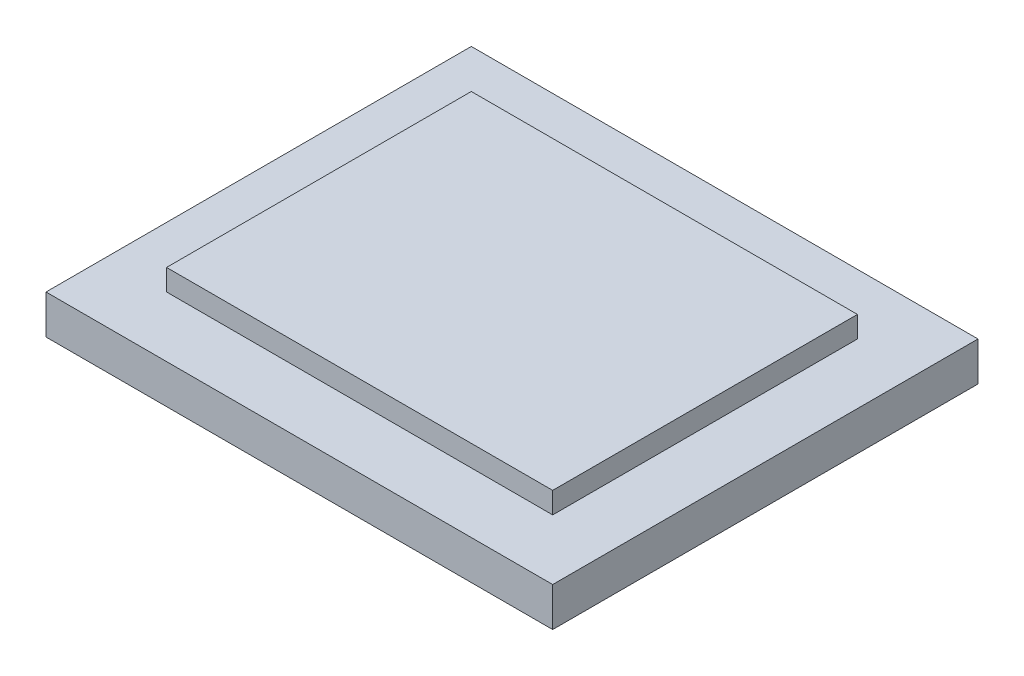
ISO-10303-21;
HEADER;
FILE_DESCRIPTION(('STEP AP214'),'2;1');
FILE_NAME('part.step','',(''),(''),'','','');
FILE_SCHEMA(('AUTOMOTIVE_DESIGN { 1 0 10303 214 1 1 1 1 }'));
ENDSEC;
DATA;
#1=APPLICATION_CONTEXT('core data for automotive mechanical design processes');
#2=APPLICATION_PROTOCOL_DEFINITION('international standard','automotive_design',2000,#1);
#3=PRODUCT_CONTEXT('',#1,'mechanical');
#4=PRODUCT('Part','Part','',(#3));
#5=PRODUCT_RELATED_PRODUCT_CATEGORY('part','',(#4));
#6=PRODUCT_DEFINITION_FORMATION('','',#4);
#7=PRODUCT_DEFINITION_CONTEXT('part definition',#1,'design');
#8=PRODUCT_DEFINITION('design','',#6,#7);
#9=PRODUCT_DEFINITION_SHAPE('','',#8);
#10=(LENGTH_UNIT() NAMED_UNIT(*) SI_UNIT(.MILLI.,.METRE.));
#11=(NAMED_UNIT(*) PLANE_ANGLE_UNIT() SI_UNIT($,.RADIAN.));
#12=(NAMED_UNIT(*) SI_UNIT($,.STERADIAN.) SOLID_ANGLE_UNIT());
#13=UNCERTAINTY_MEASURE_WITH_UNIT(LENGTH_MEASURE(1.E-05),#10,'distance_accuracy_value','');
#14=(GEOMETRIC_REPRESENTATION_CONTEXT(3) GLOBAL_UNCERTAINTY_ASSIGNED_CONTEXT((#13)) GLOBAL_UNIT_ASSIGNED_CONTEXT((#10,
#11,#12)) REPRESENTATION_CONTEXT('',''));
#15=CARTESIAN_POINT('',(0.,0.,0.));
#16=DIRECTION('',(0.,0.,1.));
#17=DIRECTION('',(1.,0.,0.));
#18=AXIS2_PLACEMENT_3D('',#15,#16,#17);
#19=CARTESIAN_POINT('',(-75.65,18.,-63.5));
#20=DIRECTION('',(1.,0.,0.));
#21=DIRECTION('',(0.,0.,-1.));
#22=AXIS2_PLACEMENT_3D('',#19,#20,#21);
#23=PLANE('',#22);
#24=DIRECTION('',(0.,0.,1.));
#25=VECTOR('',#24,1.);
#26=CARTESIAN_POINT('',(-75.65,11.65,-63.5));
#27=LINE('',#26,#25);
#28=CARTESIAN_POINT('',(-75.65,11.65,-63.5));
#29=VERTEX_POINT('',#28);
#30=CARTESIAN_POINT('',(-75.65,11.65,63.5));
#31=VERTEX_POINT('',#30);
#32=EDGE_CURVE('E120',#29,#31,#27,.T.);
#33=ORIENTED_EDGE('',*,*,#32,.F.);
#34=DIRECTION('',(0.,-1.,0.));
#35=VECTOR('',#34,1.);
#36=CARTESIAN_POINT('',(-75.65,18.,-63.5));
#37=LINE('',#36,#35);
#38=CARTESIAN_POINT('',(-75.65,0.,-63.5));
#39=VERTEX_POINT('',#38);
#40=EDGE_CURVE('E57',#29,#39,#37,.T.);
#41=ORIENTED_EDGE('',*,*,#40,.T.);
#42=DIRECTION('',(0.,0.,1.));
#43=VECTOR('',#42,1.);
#44=CARTESIAN_POINT('',(-75.65,0.,-63.5));
#45=LINE('',#44,#43);
#46=CARTESIAN_POINT('',(-75.65,0.,63.5));
#47=VERTEX_POINT('',#46);
#48=EDGE_CURVE('E137',#39,#47,#45,.T.);
#49=ORIENTED_EDGE('',*,*,#48,.T.);
#50=DIRECTION('',(0.,-1.,0.));
#51=VECTOR('',#50,1.);
#52=CARTESIAN_POINT('',(-75.65,18.,63.5));
#53=LINE('',#52,#51);
#54=EDGE_CURVE('E42',#31,#47,#53,.T.);
#55=ORIENTED_EDGE('',*,*,#54,.F.);
#56=EDGE_LOOP('',(#33,#41,#49,#55));
#57=FACE_BOUND('',#56,.T.);
#58=ADVANCED_FACE('F35',(#57),#23,.F.);
#59=CARTESIAN_POINT('',(75.65,18.,-63.5));
#60=DIRECTION('',(-1.,0.,0.));
#61=DIRECTION('',(0.,0.,1.));
#62=AXIS2_PLACEMENT_3D('',#59,#60,#61);
#63=PLANE('',#62);
#64=DIRECTION('',(0.,0.,-1.));
#65=VECTOR('',#64,1.);
#66=CARTESIAN_POINT('',(75.65,11.65,63.5));
#67=LINE('',#66,#65);
#68=CARTESIAN_POINT('',(75.65,11.65,63.5));
#69=VERTEX_POINT('',#68);
#70=CARTESIAN_POINT('',(75.65,11.65,-63.5));
#71=VERTEX_POINT('',#70);
#72=EDGE_CURVE('E129',#69,#71,#67,.T.);
#73=ORIENTED_EDGE('',*,*,#72,.F.);
#74=DIRECTION('',(0.,-1.,0.));
#75=VECTOR('',#74,1.);
#76=CARTESIAN_POINT('',(75.65,18.,63.5));
#77=LINE('',#76,#75);
#78=CARTESIAN_POINT('',(75.65,0.,63.5));
#79=VERTEX_POINT('',#78);
#80=EDGE_CURVE('E151',#69,#79,#77,.T.);
#81=ORIENTED_EDGE('',*,*,#80,.T.);
#82=DIRECTION('',(0.,0.,-1.));
#83=VECTOR('',#82,1.);
#84=CARTESIAN_POINT('',(75.65,0.,-63.5));
#85=LINE('',#84,#83);
#86=CARTESIAN_POINT('',(75.65,0.,-63.5));
#87=VERTEX_POINT('',#86);
#88=EDGE_CURVE('E143',#79,#87,#85,.T.);
#89=ORIENTED_EDGE('',*,*,#88,.T.);
#90=DIRECTION('',(0.,-1.,0.));
#91=VECTOR('',#90,1.);
#92=CARTESIAN_POINT('',(75.65,18.,-63.5));
#93=LINE('',#92,#91);
#94=EDGE_CURVE('E149',#71,#87,#93,.T.);
#95=ORIENTED_EDGE('',*,*,#94,.F.);
#96=EDGE_LOOP('',(#73,#81,#89,#95));
#97=FACE_BOUND('',#96,.T.);
#98=ADVANCED_FACE('F164',(#97),#63,.F.);
#99=CARTESIAN_POINT('',(75.65,18.,63.5));
#100=DIRECTION('',(0.,0.,-1.));
#101=DIRECTION('',(-1.,0.,0.));
#102=AXIS2_PLACEMENT_3D('',#99,#100,#101);
#103=PLANE('',#102);
#104=DIRECTION('',(1.,0.,0.));
#105=VECTOR('',#104,1.);
#106=CARTESIAN_POINT('',(75.65,11.65,63.5));
#107=LINE('',#106,#105);
#108=EDGE_CURVE('E135',#31,#69,#107,.T.);
#109=ORIENTED_EDGE('',*,*,#108,.F.);
#110=ORIENTED_EDGE('',*,*,#54,.T.);
#111=DIRECTION('',(1.,0.,0.));
#112=VECTOR('',#111,1.);
#113=CARTESIAN_POINT('',(75.65,0.,63.5));
#114=LINE('',#113,#112);
#115=EDGE_CURVE('E140',#47,#79,#114,.T.);
#116=ORIENTED_EDGE('',*,*,#115,.T.);
#117=ORIENTED_EDGE('',*,*,#80,.F.);
#118=EDGE_LOOP('',(#109,#110,#116,#117));
#119=FACE_BOUND('',#118,.T.);
#120=ADVANCED_FACE('F156',(#119),#103,.F.);
#121=CARTESIAN_POINT('',(75.65,18.,-63.5));
#122=DIRECTION('',(0.,0.,1.));
#123=DIRECTION('',(1.,0.,0.));
#124=AXIS2_PLACEMENT_3D('',#121,#122,#123);
#125=PLANE('',#124);
#126=ORIENTED_EDGE('',*,*,#40,.F.);
#127=DIRECTION('',(-1.,0.,0.));
#128=VECTOR('',#127,1.);
#129=CARTESIAN_POINT('',(75.65,11.65,-63.5));
#130=LINE('',#129,#128);
#131=EDGE_CURVE('E131',#71,#29,#130,.T.);
#132=ORIENTED_EDGE('',*,*,#131,.F.);
#133=ORIENTED_EDGE('',*,*,#94,.T.);
#134=DIRECTION('',(-1.,0.,0.));
#135=VECTOR('',#134,1.);
#136=CARTESIAN_POINT('',(75.65,0.,-63.5));
#137=LINE('',#136,#135);
#138=EDGE_CURVE('E146',#87,#39,#137,.T.);
#139=ORIENTED_EDGE('',*,*,#138,.T.);
#140=EDGE_LOOP('',(#126,#132,#133,#139));
#141=FACE_BOUND('',#140,.T.);
#142=ADVANCED_FACE('F173',(#141),#125,.F.);
#143=CARTESIAN_POINT('',(0.,18.,0.));
#144=DIRECTION('',(0.,-1.,0.));
#145=DIRECTION('',(0.,0.,-1.));
#146=AXIS2_PLACEMENT_3D('',#143,#144,#145);
#147=PLANE('',#146);
#148=DIRECTION('',(0.,0.,1.));
#149=VECTOR('',#148,1.);
#150=CARTESIAN_POINT('',(57.65,18.,63.5));
#151=LINE('',#150,#149);
#152=CARTESIAN_POINT('',(57.65,18.,-45.5));
#153=VERTEX_POINT('',#152);
#154=CARTESIAN_POINT('',(57.65,18.,45.5));
#155=VERTEX_POINT('',#154);
#156=EDGE_CURVE('E115',#153,#155,#151,.T.);
#157=ORIENTED_EDGE('',*,*,#156,.F.);
#158=DIRECTION('',(1.,0.,0.));
#159=VECTOR('',#158,1.);
#160=CARTESIAN_POINT('',(-75.65,18.,-45.5));
#161=LINE('',#160,#159);
#162=CARTESIAN_POINT('',(-57.65,18.,-45.5));
#163=VERTEX_POINT('',#162);
#164=EDGE_CURVE('E102',#163,#153,#161,.T.);
#165=ORIENTED_EDGE('',*,*,#164,.F.);
#166=DIRECTION('',(0.,0.,-1.));
#167=VECTOR('',#166,1.);
#168=CARTESIAN_POINT('',(-57.65,18.,-63.5));
#169=LINE('',#168,#167);
#170=CARTESIAN_POINT('',(-57.65,18.,45.5));
#171=VERTEX_POINT('',#170);
#172=EDGE_CURVE('E114',#171,#163,#169,.T.);
#173=ORIENTED_EDGE('',*,*,#172,.F.);
#174=DIRECTION('',(-1.,0.,0.));
#175=VECTOR('',#174,1.);
#176=CARTESIAN_POINT('',(-75.65,18.,45.5));
#177=LINE('',#176,#175);
#178=EDGE_CURVE('E266',#155,#171,#177,.T.);
#179=ORIENTED_EDGE('',*,*,#178,.F.);
#180=EDGE_LOOP('',(#157,#165,#173,#179));
#181=FACE_BOUND('',#180,.T.);
#182=ADVANCED_FACE('F112',(#181),#147,.F.);
#183=CARTESIAN_POINT('',(0.,0.,0.));
#184=DIRECTION('',(0.,-1.,0.));
#185=DIRECTION('',(0.,0.,-1.));
#186=AXIS2_PLACEMENT_3D('',#183,#184,#185);
#187=PLANE('',#186);
#188=ORIENTED_EDGE('',*,*,#48,.F.);
#189=ORIENTED_EDGE('',*,*,#138,.F.);
#190=ORIENTED_EDGE('',*,*,#88,.F.);
#191=ORIENTED_EDGE('',*,*,#115,.F.);
#192=EDGE_LOOP('',(#188,#189,#190,#191));
#193=FACE_BOUND('',#192,.T.);
#194=ADVANCED_FACE('F161',(#193),#187,.T.);
#195=CARTESIAN_POINT('',(57.65,11.65,63.5));
#196=DIRECTION('',(-1.,0.,0.));
#197=DIRECTION('',(0.,0.,1.));
#198=AXIS2_PLACEMENT_3D('',#195,#196,#197);
#199=PLANE('',#198);
#200=DIRECTION('',(0.,0.,1.));
#201=VECTOR('',#200,1.);
#202=CARTESIAN_POINT('',(57.65,11.65,63.5));
#203=LINE('',#202,#201);
#204=CARTESIAN_POINT('',(57.65,11.65,-45.5));
#205=VERTEX_POINT('',#204);
#206=CARTESIAN_POINT('',(57.65,11.65,45.5));
#207=VERTEX_POINT('',#206);
#208=EDGE_CURVE('E133',#205,#207,#203,.T.);
#209=ORIENTED_EDGE('',*,*,#208,.F.);
#210=DIRECTION('',(0.,1.,0.));
#211=VECTOR('',#210,1.);
#212=CARTESIAN_POINT('',(57.65,11.65,-45.5));
#213=LINE('',#212,#211);
#214=EDGE_CURVE('E267',#205,#153,#213,.T.);
#215=ORIENTED_EDGE('',*,*,#214,.T.);
#216=ORIENTED_EDGE('',*,*,#156,.T.);
#217=DIRECTION('',(0.,-1.,0.));
#218=VECTOR('',#217,1.);
#219=CARTESIAN_POINT('',(57.65,11.65,45.5));
#220=LINE('',#219,#218);
#221=EDGE_CURVE('E121',#155,#207,#220,.T.);
#222=ORIENTED_EDGE('',*,*,#221,.T.);
#223=EDGE_LOOP('',(#209,#215,#216,#222));
#224=FACE_BOUND('',#223,.T.);
#225=ADVANCED_FACE('F181',(#224),#199,.F.);
#226=CARTESIAN_POINT('',(0.,11.65,0.));
#227=DIRECTION('',(0.,1.,0.));
#228=DIRECTION('',(0.,0.,1.));
#229=AXIS2_PLACEMENT_3D('',#226,#227,#228);
#230=PLANE('',#229);
#231=DIRECTION('',(1.,0.,0.));
#232=VECTOR('',#231,1.);
#233=CARTESIAN_POINT('',(-75.65,11.65,-45.5));
#234=LINE('',#233,#232);
#235=CARTESIAN_POINT('',(-57.65,11.65,-45.5));
#236=VERTEX_POINT('',#235);
#237=EDGE_CURVE('E105',#236,#205,#234,.T.);
#238=ORIENTED_EDGE('',*,*,#237,.T.);
#239=ORIENTED_EDGE('',*,*,#208,.T.);
#240=DIRECTION('',(-1.,0.,0.));
#241=VECTOR('',#240,1.);
#242=CARTESIAN_POINT('',(-75.65,11.65,45.5));
#243=LINE('',#242,#241);
#244=CARTESIAN_POINT('',(-57.65,11.65,45.5));
#245=VERTEX_POINT('',#244);
#246=EDGE_CURVE('E49',#207,#245,#243,.T.);
#247=ORIENTED_EDGE('',*,*,#246,.T.);
#248=DIRECTION('',(0.,0.,-1.));
#249=VECTOR('',#248,1.);
#250=CARTESIAN_POINT('',(-57.65,11.65,-63.5));
#251=LINE('',#250,#249);
#252=EDGE_CURVE('E123',#245,#236,#251,.T.);
#253=ORIENTED_EDGE('',*,*,#252,.T.);
#254=EDGE_LOOP('',(#238,#239,#247,#253));
#255=FACE_BOUND('',#254,.T.);
#256=ORIENTED_EDGE('',*,*,#131,.T.);
#257=ORIENTED_EDGE('',*,*,#32,.T.);
#258=ORIENTED_EDGE('',*,*,#108,.T.);
#259=ORIENTED_EDGE('',*,*,#72,.T.);
#260=EDGE_LOOP('',(#256,#257,#258,#259));
#261=FACE_BOUND('',#260,.T.);
#262=ADVANCED_FACE('F186',(#255,#261),#230,.T.);
#263=CARTESIAN_POINT('',(-57.65,11.65,-63.5));
#264=DIRECTION('',(1.,0.,0.));
#265=DIRECTION('',(0.,0.,-1.));
#266=AXIS2_PLACEMENT_3D('',#263,#264,#265);
#267=PLANE('',#266);
#268=ORIENTED_EDGE('',*,*,#172,.T.);
#269=DIRECTION('',(0.,-1.,0.));
#270=VECTOR('',#269,1.);
#271=CARTESIAN_POINT('',(-57.65,11.65,-45.5));
#272=LINE('',#271,#270);
#273=EDGE_CURVE('E11',#163,#236,#272,.T.);
#274=ORIENTED_EDGE('',*,*,#273,.T.);
#275=ORIENTED_EDGE('',*,*,#252,.F.);
#276=DIRECTION('',(0.,1.,0.));
#277=VECTOR('',#276,1.);
#278=CARTESIAN_POINT('',(-57.65,11.65,45.5));
#279=LINE('',#278,#277);
#280=EDGE_CURVE('E119',#245,#171,#279,.T.);
#281=ORIENTED_EDGE('',*,*,#280,.T.);
#282=EDGE_LOOP('',(#268,#274,#275,#281));
#283=FACE_BOUND('',#282,.T.);
#284=ADVANCED_FACE('F118',(#283),#267,.F.);
#285=CARTESIAN_POINT('',(-75.65,11.65,45.5));
#286=DIRECTION('',(0.,0.,-1.));
#287=DIRECTION('',(-1.,0.,0.));
#288=AXIS2_PLACEMENT_3D('',#285,#286,#287);
#289=PLANE('',#288);
#290=ORIENTED_EDGE('',*,*,#178,.T.);
#291=ORIENTED_EDGE('',*,*,#280,.F.);
#292=ORIENTED_EDGE('',*,*,#246,.F.);
#293=ORIENTED_EDGE('',*,*,#221,.F.);
#294=EDGE_LOOP('',(#290,#291,#292,#293));
#295=FACE_BOUND('',#294,.T.);
#296=ADVANCED_FACE('F192',(#295),#289,.F.);
#297=CARTESIAN_POINT('',(-75.65,11.65,-45.5));
#298=DIRECTION('',(0.,0.,1.));
#299=DIRECTION('',(1.,0.,0.));
#300=AXIS2_PLACEMENT_3D('',#297,#298,#299);
#301=PLANE('',#300);
#302=ORIENTED_EDGE('',*,*,#237,.F.);
#303=ORIENTED_EDGE('',*,*,#273,.F.);
#304=ORIENTED_EDGE('',*,*,#164,.T.);
#305=ORIENTED_EDGE('',*,*,#214,.F.);
#306=EDGE_LOOP('',(#302,#303,#304,#305));
#307=FACE_BOUND('',#306,.T.);
#308=ADVANCED_FACE('F101',(#307),#301,.F.);
#309=CLOSED_SHELL('',(#58,#98,#120,#142,#182,#194,#225,#262,#284,#296,#308));
#310=MANIFOLD_SOLID_BREP('B2',#309);
#311=ADVANCED_BREP_SHAPE_REPRESENTATION('',(#18,#310),#14);
#312=SHAPE_DEFINITION_REPRESENTATION(#9,#311);
ENDSEC;
END-ISO-10303-21;
